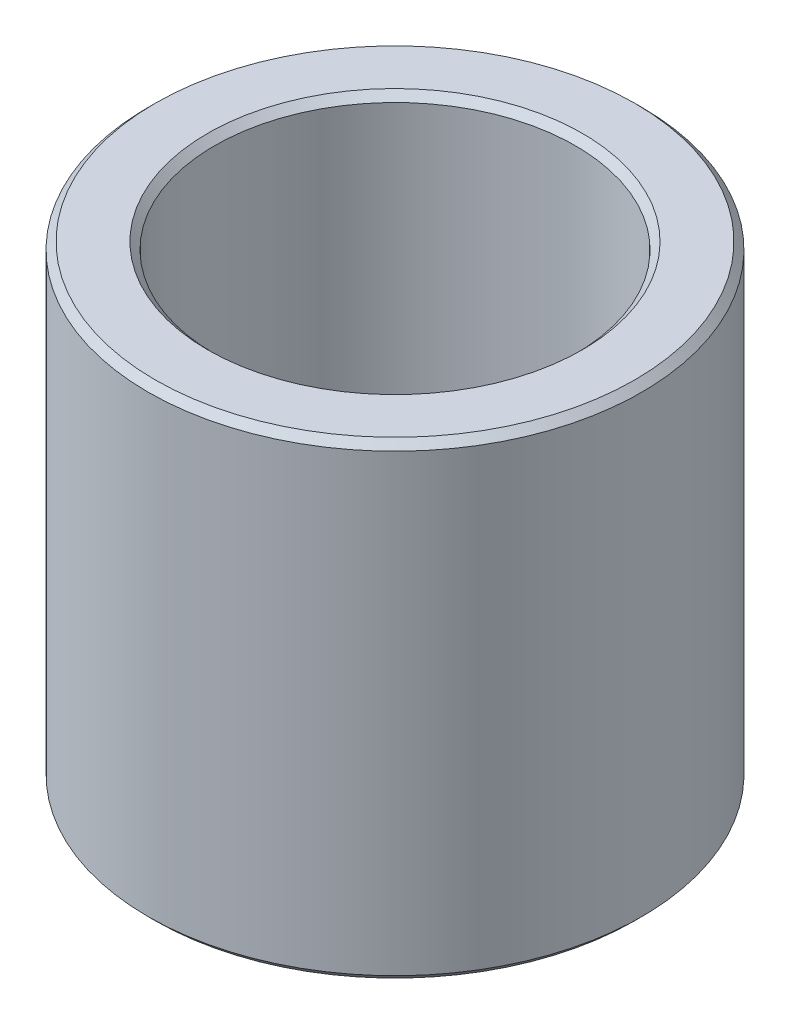
ISO-10303-21;
HEADER;
FILE_DESCRIPTION(('STEP AP214'),'2;1');
FILE_NAME('part.step','',(''),(''),'','','');
FILE_SCHEMA(('AUTOMOTIVE_DESIGN { 1 0 10303 214 1 1 1 1 }'));
ENDSEC;
DATA;
#1=APPLICATION_CONTEXT('core data for automotive mechanical design processes');
#2=APPLICATION_PROTOCOL_DEFINITION('international standard','automotive_design',2000,#1);
#3=PRODUCT_CONTEXT('',#1,'mechanical');
#4=PRODUCT('Part','Part','',(#3));
#5=PRODUCT_RELATED_PRODUCT_CATEGORY('part','',(#4));
#6=PRODUCT_DEFINITION_FORMATION('','',#4);
#7=PRODUCT_DEFINITION_CONTEXT('part definition',#1,'design');
#8=PRODUCT_DEFINITION('design','',#6,#7);
#9=PRODUCT_DEFINITION_SHAPE('','',#8);
#10=(LENGTH_UNIT() NAMED_UNIT(*) SI_UNIT(.MILLI.,.METRE.));
#11=(NAMED_UNIT(*) PLANE_ANGLE_UNIT() SI_UNIT($,.RADIAN.));
#12=(NAMED_UNIT(*) SI_UNIT($,.STERADIAN.) SOLID_ANGLE_UNIT());
#13=UNCERTAINTY_MEASURE_WITH_UNIT(LENGTH_MEASURE(1.E-05),#10,'distance_accuracy_value','');
#14=(GEOMETRIC_REPRESENTATION_CONTEXT(3) GLOBAL_UNCERTAINTY_ASSIGNED_CONTEXT((#13)) GLOBAL_UNIT_ASSIGNED_CONTEXT((#10,
#11,#12)) REPRESENTATION_CONTEXT('',''));
#15=CARTESIAN_POINT('',(0.,0.,0.));
#16=DIRECTION('',(0.,0.,1.));
#17=DIRECTION('',(1.,0.,0.));
#18=AXIS2_PLACEMENT_3D('',#15,#16,#17);
#19=CARTESIAN_POINT('',(0.,47.4500141826427,0.));
#20=DIRECTION('',(0.,-1.,0.));
#21=DIRECTION('',(0.,0.,-1.));
#22=AXIS2_PLACEMENT_3D('',#19,#20,#21);
#23=CYLINDRICAL_SURFACE('',#22,25.);
#24=CARTESIAN_POINT('',(0.,0.717748939812218,0.));
#25=DIRECTION('',(0.,1.,0.));
#26=DIRECTION('',(0.,0.,1.));
#27=AXIS2_PLACEMENT_3D('',#24,#25,#26);
#28=CIRCLE('',#27,25.);
#29=CARTESIAN_POINT('',(0.,0.717748939812218,25.));
#30=VERTEX_POINT('',#29);
#31=EDGE_CURVE('E10',#30,#30,#28,.T.);
#32=ORIENTED_EDGE('',*,*,#31,.T.);
#33=EDGE_LOOP('',(#32));
#34=FACE_BOUND('',#33,.T.);
#35=CARTESIAN_POINT('',(0.,46.7322652428304,0.));
#36=DIRECTION('',(0.,1.,0.));
#37=DIRECTION('',(0.,0.,1.));
#38=AXIS2_PLACEMENT_3D('',#35,#36,#37);
#39=CIRCLE('',#38,25.);
#40=CARTESIAN_POINT('',(0.,46.7322652428304,25.));
#41=VERTEX_POINT('',#40);
#42=EDGE_CURVE('E50',#41,#41,#39,.F.);
#43=ORIENTED_EDGE('',*,*,#42,.T.);
#44=EDGE_LOOP('',(#43));
#45=FACE_BOUND('',#44,.T.);
#46=ADVANCED_FACE('F39',(#34,#45),#23,.T.);
#47=CARTESIAN_POINT('',(0.,47.4500141826427,0.));
#48=DIRECTION('',(0.,1.,0.));
#49=DIRECTION('',(0.,0.,1.));
#50=AXIS2_PLACEMENT_3D('',#47,#48,#49);
#51=PLANE('',#50);
#52=CARTESIAN_POINT('',(0.,47.4500141826427,0.));
#53=DIRECTION('',(0.,1.,0.));
#54=DIRECTION('',(0.,0.,1.));
#55=AXIS2_PLACEMENT_3D('',#52,#53,#54);
#56=CIRCLE('',#55,18.9887699466325);
#57=CARTESIAN_POINT('',(0.,47.4500141826427,18.9887699466325));
#58=VERTEX_POINT('',#57);
#59=EDGE_CURVE('E58',#58,#58,#56,.F.);
#60=ORIENTED_EDGE('',*,*,#59,.T.);
#61=EDGE_LOOP('',(#60));
#62=FACE_BOUND('',#61,.T.);
#63=CARTESIAN_POINT('',(0.,47.4500141826427,0.));
#64=DIRECTION('',(0.,1.,0.));
#65=DIRECTION('',(0.,0.,1.));
#66=AXIS2_PLACEMENT_3D('',#63,#64,#65);
#67=CIRCLE('',#66,24.2822510601878);
#68=CARTESIAN_POINT('',(0.,47.4500141826427,24.2822510601878));
#69=VERTEX_POINT('',#68);
#70=EDGE_CURVE('E61',#69,#69,#67,.T.);
#71=ORIENTED_EDGE('',*,*,#70,.T.);
#72=EDGE_LOOP('',(#71));
#73=FACE_BOUND('',#72,.T.);
#74=ADVANCED_FACE('F88',(#62,#73),#51,.T.);
#75=CARTESIAN_POINT('',(0.,0.,0.));
#76=DIRECTION('',(0.,1.,0.));
#77=DIRECTION('',(0.,0.,1.));
#78=AXIS2_PLACEMENT_3D('',#75,#76,#77);
#79=PLANE('',#78);
#80=CARTESIAN_POINT('',(0.,0.,0.));
#81=DIRECTION('',(0.,1.,0.));
#82=DIRECTION('',(0.,0.,1.));
#83=AXIS2_PLACEMENT_3D('',#80,#81,#82);
#84=CIRCLE('',#83,18.9887699466325);
#85=CARTESIAN_POINT('',(0.,0.,18.9887699466325));
#86=VERTEX_POINT('',#85);
#87=EDGE_CURVE('E51',#86,#86,#84,.T.);
#88=ORIENTED_EDGE('',*,*,#87,.T.);
#89=EDGE_LOOP('',(#88));
#90=FACE_BOUND('',#89,.T.);
#91=CARTESIAN_POINT('',(0.,0.,0.));
#92=DIRECTION('',(0.,1.,0.));
#93=DIRECTION('',(0.,0.,1.));
#94=AXIS2_PLACEMENT_3D('',#91,#92,#93);
#95=CIRCLE('',#94,24.2822510601878);
#96=CARTESIAN_POINT('',(0.,0.,24.2822510601878));
#97=VERTEX_POINT('',#96);
#98=EDGE_CURVE('E54',#97,#97,#95,.F.);
#99=ORIENTED_EDGE('',*,*,#98,.T.);
#100=EDGE_LOOP('',(#99));
#101=FACE_BOUND('',#100,.T.);
#102=ADVANCED_FACE('F83',(#90,#101),#79,.F.);
#103=CARTESIAN_POINT('',(0.,47.4500141826427,0.));
#104=DIRECTION('',(0.,-1.,0.));
#105=DIRECTION('',(0.,0.,-1.));
#106=AXIS2_PLACEMENT_3D('',#103,#104,#105);
#107=CYLINDRICAL_SURFACE('',#106,18.2710210068203);
#108=CARTESIAN_POINT('',(0.,46.7322652428305,0.));
#109=DIRECTION('',(0.,1.,0.));
#110=DIRECTION('',(0.,0.,1.));
#111=AXIS2_PLACEMENT_3D('',#108,#109,#110);
#112=CIRCLE('',#111,18.2710210068203);
#113=CARTESIAN_POINT('',(0.,46.7322652428305,18.2710210068203));
#114=VERTEX_POINT('',#113);
#115=EDGE_CURVE('E67',#114,#114,#112,.T.);
#116=ORIENTED_EDGE('',*,*,#115,.T.);
#117=EDGE_LOOP('',(#116));
#118=FACE_BOUND('',#117,.T.);
#119=CARTESIAN_POINT('',(0.,0.717748939812239,0.));
#120=DIRECTION('',(0.,1.,0.));
#121=DIRECTION('',(0.,0.,1.));
#122=AXIS2_PLACEMENT_3D('',#119,#120,#121);
#123=CIRCLE('',#122,18.2710210068203);
#124=CARTESIAN_POINT('',(0.,0.717748939812239,18.2710210068203));
#125=VERTEX_POINT('',#124);
#126=EDGE_CURVE('E69',#125,#125,#123,.F.);
#127=ORIENTED_EDGE('',*,*,#126,.T.);
#128=EDGE_LOOP('',(#127));
#129=FACE_BOUND('',#128,.T.);
#130=ADVANCED_FACE('F71',(#118,#129),#107,.F.);
#131=CARTESIAN_POINT('',(0.,46.7322652428305,0.));
#132=DIRECTION('',(0.,1.,0.));
#133=DIRECTION('',(0.,0.,1.));
#134=AXIS2_PLACEMENT_3D('',#131,#132,#133);
#135=CONICAL_SURFACE('',#134,18.2710210068203,0.785398163397448);
#136=ORIENTED_EDGE('',*,*,#59,.F.);
#137=EDGE_LOOP('',(#136));
#138=FACE_BOUND('',#137,.T.);
#139=ORIENTED_EDGE('',*,*,#115,.F.);
#140=EDGE_LOOP('',(#139));
#141=FACE_BOUND('',#140,.T.);
#142=ADVANCED_FACE('F77',(#138,#141),#135,.F.);
#143=CARTESIAN_POINT('',(0.,0.,0.));
#144=DIRECTION('',(0.,-1.,0.));
#145=DIRECTION('',(0.,0.,-1.));
#146=AXIS2_PLACEMENT_3D('',#143,#144,#145);
#147=CONICAL_SURFACE('',#146,18.9887699466325,0.785398163397439);
#148=ORIENTED_EDGE('',*,*,#126,.F.);
#149=EDGE_LOOP('',(#148));
#150=FACE_BOUND('',#149,.T.);
#151=ORIENTED_EDGE('',*,*,#87,.F.);
#152=EDGE_LOOP('',(#151));
#153=FACE_BOUND('',#152,.T.);
#154=ADVANCED_FACE('F73',(#150,#153),#147,.F.);
#155=CARTESIAN_POINT('',(0.,0.717748939812218,0.));
#156=DIRECTION('',(0.,1.,0.));
#157=DIRECTION('',(0.,0.,1.));
#158=AXIS2_PLACEMENT_3D('',#155,#156,#157);
#159=CONICAL_SURFACE('',#158,25.,0.785398163397451);
#160=ORIENTED_EDGE('',*,*,#98,.F.);
#161=EDGE_LOOP('',(#160));
#162=FACE_BOUND('',#161,.T.);
#163=ORIENTED_EDGE('',*,*,#31,.F.);
#164=EDGE_LOOP('',(#163));
#165=FACE_BOUND('',#164,.T.);
#166=ADVANCED_FACE('F76',(#162,#165),#159,.T.);
#167=CARTESIAN_POINT('',(0.,47.4500141826427,0.));
#168=DIRECTION('',(0.,-1.,0.));
#169=DIRECTION('',(0.,0.,-1.));
#170=AXIS2_PLACEMENT_3D('',#167,#168,#169);
#171=CONICAL_SURFACE('',#170,24.2822510601878,0.785398163397444);
#172=ORIENTED_EDGE('',*,*,#42,.F.);
#173=EDGE_LOOP('',(#172));
#174=FACE_BOUND('',#173,.T.);
#175=ORIENTED_EDGE('',*,*,#70,.F.);
#176=EDGE_LOOP('',(#175));
#177=FACE_BOUND('',#176,.T.);
#178=ADVANCED_FACE('F45',(#174,#177),#171,.T.);
#179=CLOSED_SHELL('',(#46,#74,#102,#130,#142,#154,#166,#178));
#180=MANIFOLD_SOLID_BREP('B2',#179);
#181=ADVANCED_BREP_SHAPE_REPRESENTATION('',(#18,#180),#14);
#182=SHAPE_DEFINITION_REPRESENTATION(#9,#181);
ENDSEC;
END-ISO-10303-21;
